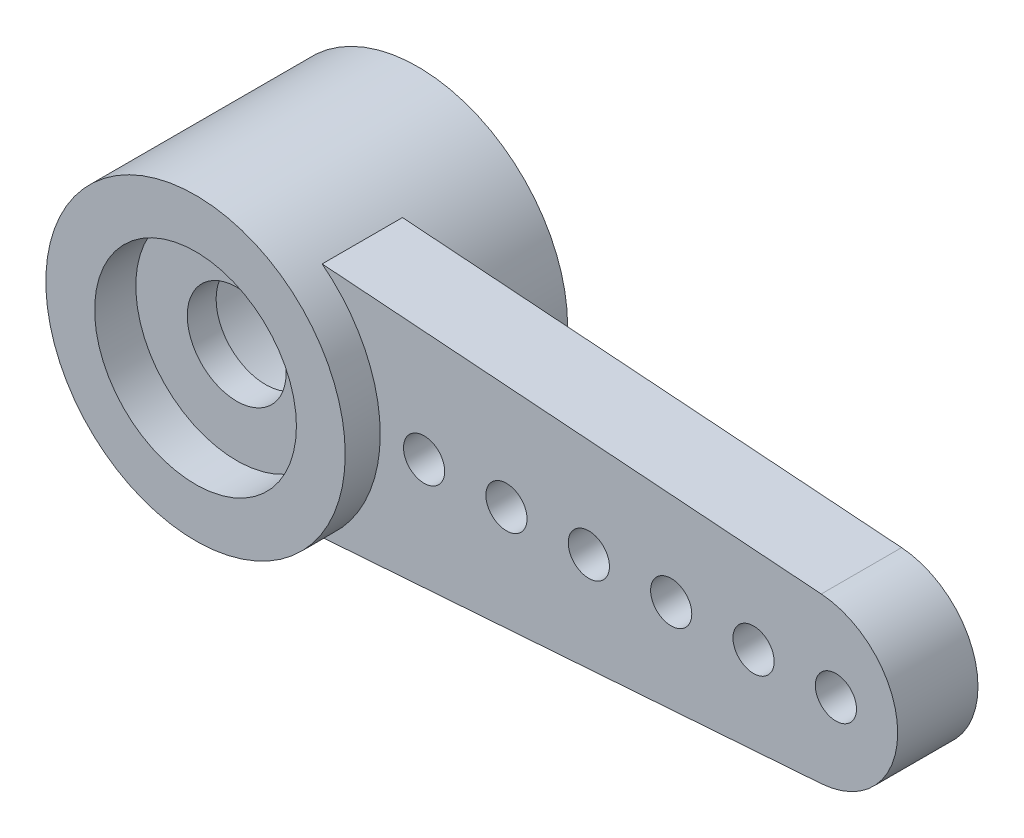
ISO-10303-21;
HEADER;
FILE_DESCRIPTION(('STEP AP214'),'2;1');
FILE_NAME('part.step','',(''),(''),'','','');
FILE_SCHEMA(('AUTOMOTIVE_DESIGN { 1 0 10303 214 1 1 1 1 }'));
ENDSEC;
DATA;
#1=APPLICATION_CONTEXT('core data for automotive mechanical design processes');
#2=APPLICATION_PROTOCOL_DEFINITION('international standard','automotive_design',2000,#1);
#3=PRODUCT_CONTEXT('',#1,'mechanical');
#4=PRODUCT('Part','Part','',(#3));
#5=PRODUCT_RELATED_PRODUCT_CATEGORY('part','',(#4));
#6=PRODUCT_DEFINITION_FORMATION('','',#4);
#7=PRODUCT_DEFINITION_CONTEXT('part definition',#1,'design');
#8=PRODUCT_DEFINITION('design','',#6,#7);
#9=PRODUCT_DEFINITION_SHAPE('','',#8);
#10=(LENGTH_UNIT() NAMED_UNIT(*) SI_UNIT(.MILLI.,.METRE.));
#11=(NAMED_UNIT(*) PLANE_ANGLE_UNIT() SI_UNIT($,.RADIAN.));
#12=(NAMED_UNIT(*) SI_UNIT($,.STERADIAN.) SOLID_ANGLE_UNIT());
#13=UNCERTAINTY_MEASURE_WITH_UNIT(LENGTH_MEASURE(1.E-05),#10,'distance_accuracy_value','');
#14=(GEOMETRIC_REPRESENTATION_CONTEXT(3) GLOBAL_UNCERTAINTY_ASSIGNED_CONTEXT((#13)) GLOBAL_UNIT_ASSIGNED_CONTEXT((#10,
#11,#12)) REPRESENTATION_CONTEXT('',''));
#15=CARTESIAN_POINT('',(0.,0.,0.));
#16=DIRECTION('',(0.,0.,1.));
#17=DIRECTION('',(1.,0.,0.));
#18=AXIS2_PLACEMENT_3D('',#15,#16,#17);
#19=CARTESIAN_POINT('',(0.,0.,5.4));
#20=DIRECTION('',(0.,0.,-1.));
#21=DIRECTION('',(-1.,0.,0.));
#22=AXIS2_PLACEMENT_3D('',#19,#20,#21);
#23=CYLINDRICAL_SURFACE('',#22,1.2);
#24=CARTESIAN_POINT('',(0.,0.,4.4));
#25=DIRECTION('',(0.,0.,1.));
#26=DIRECTION('',(1.,0.,0.));
#27=AXIS2_PLACEMENT_3D('',#24,#25,#26);
#28=CIRCLE('',#27,1.2);
#29=CARTESIAN_POINT('',(1.2,0.,4.4));
#30=VERTEX_POINT('',#29);
#31=EDGE_CURVE('E112',#30,#30,#28,.T.);
#32=ORIENTED_EDGE('',*,*,#31,.T.);
#33=EDGE_LOOP('',(#32));
#34=FACE_BOUND('',#33,.T.);
#35=CARTESIAN_POINT('',(0.,0.,3.7));
#36=DIRECTION('',(0.,0.,-1.));
#37=DIRECTION('',(-1.,0.,0.));
#38=AXIS2_PLACEMENT_3D('',#35,#36,#37);
#39=CIRCLE('',#38,1.2);
#40=CARTESIAN_POINT('',(-1.2,0.,3.7));
#41=VERTEX_POINT('',#40);
#42=EDGE_CURVE('E43',#41,#41,#39,.T.);
#43=ORIENTED_EDGE('',*,*,#42,.T.);
#44=EDGE_LOOP('',(#43));
#45=FACE_BOUND('',#44,.T.);
#46=ADVANCED_FACE('F39',(#34,#45),#23,.F.);
#47=CARTESIAN_POINT('',(0.,0.,5.4));
#48=DIRECTION('',(0.,0.,-1.));
#49=DIRECTION('',(-1.,0.,0.));
#50=AXIS2_PLACEMENT_3D('',#47,#48,#49);
#51=CYLINDRICAL_SURFACE('',#50,3.635);
#52=CARTESIAN_POINT('',(0.,0.,0.));
#53=DIRECTION('',(0.,0.,1.));
#54=DIRECTION('',(1.,0.,0.));
#55=AXIS2_PLACEMENT_3D('',#52,#53,#54);
#56=CIRCLE('',#55,3.635);
#57=CARTESIAN_POINT('',(3.635,0.,0.));
#58=VERTEX_POINT('',#57);
#59=EDGE_CURVE('E48',#58,#58,#56,.T.);
#60=ORIENTED_EDGE('',*,*,#59,.T.);
#61=EDGE_LOOP('',(#60));
#62=FACE_BOUND('',#61,.T.);
#63=CARTESIAN_POINT('',(0.,0.,5.4));
#64=DIRECTION('',(0.,0.,1.));
#65=DIRECTION('',(1.,0.,0.));
#66=AXIS2_PLACEMENT_3D('',#63,#64,#65);
#67=CIRCLE('',#66,3.635);
#68=CARTESIAN_POINT('',(3.635,0.,5.4));
#69=VERTEX_POINT('',#68);
#70=EDGE_CURVE('E11',#69,#69,#67,.T.);
#71=ORIENTED_EDGE('',*,*,#70,.F.);
#72=EDGE_LOOP('',(#71));
#73=FACE_BOUND('',#72,.T.);
#74=CARTESIAN_POINT('',(0.,0.,2.6));
#75=DIRECTION('',(0.,0.,1.));
#76=DIRECTION('',(1.,0.,0.));
#77=AXIS2_PLACEMENT_3D('',#74,#75,#76);
#78=CIRCLE('',#77,3.635);
#79=CARTESIAN_POINT('',(2.22432012084592,2.875,2.6));
#80=VERTEX_POINT('',#79);
#81=CARTESIAN_POINT('',(2.22432012084592,-2.875,2.6));
#82=VERTEX_POINT('',#81);
#83=EDGE_CURVE('E103',#80,#82,#78,.F.);
#84=ORIENTED_EDGE('',*,*,#83,.T.);
#85=DIRECTION('',(0.,0.,1.));
#86=VECTOR('',#85,1.);
#87=CARTESIAN_POINT('',(2.22432012084592,-2.875,2.6));
#88=LINE('',#87,#86);
#89=CARTESIAN_POINT('',(2.22432012084592,-2.875,4.55));
#90=VERTEX_POINT('',#89);
#91=EDGE_CURVE('E87',#82,#90,#88,.T.);
#92=ORIENTED_EDGE('',*,*,#91,.T.);
#93=CARTESIAN_POINT('',(0.,0.,4.55));
#94=DIRECTION('',(0.,0.,1.));
#95=DIRECTION('',(1.,0.,0.));
#96=AXIS2_PLACEMENT_3D('',#93,#94,#95);
#97=CIRCLE('',#96,3.635);
#98=CARTESIAN_POINT('',(2.22432012084592,2.875,4.55));
#99=VERTEX_POINT('',#98);
#100=EDGE_CURVE('E109',#99,#90,#97,.F.);
#101=ORIENTED_EDGE('',*,*,#100,.F.);
#102=DIRECTION('',(0.,0.,1.));
#103=VECTOR('',#102,1.);
#104=CARTESIAN_POINT('',(2.22432012084592,2.875,2.6));
#105=LINE('',#104,#103);
#106=EDGE_CURVE('E116',#80,#99,#105,.T.);
#107=ORIENTED_EDGE('',*,*,#106,.F.);
#108=EDGE_LOOP('',(#84,#92,#101,#107));
#109=FACE_BOUND('',#108,.T.);
#110=ADVANCED_FACE('F41',(#62,#73,#109),#51,.T.);
#111=CARTESIAN_POINT('',(0.,0.,5.4));
#112=DIRECTION('',(0.,0.,1.));
#113=DIRECTION('',(1.,0.,0.));
#114=AXIS2_PLACEMENT_3D('',#111,#112,#113);
#115=PLANE('',#114);
#116=CARTESIAN_POINT('',(0.,0.,5.4));
#117=DIRECTION('',(0.,0.,1.));
#118=DIRECTION('',(1.,0.,0.));
#119=AXIS2_PLACEMENT_3D('',#116,#117,#118);
#120=CIRCLE('',#119,2.45);
#121=CARTESIAN_POINT('',(2.45,0.,5.4));
#122=VERTEX_POINT('',#121);
#123=EDGE_CURVE('E126',#122,#122,#120,.T.);
#124=ORIENTED_EDGE('',*,*,#123,.F.);
#125=EDGE_LOOP('',(#124));
#126=FACE_BOUND('',#125,.T.);
#127=ORIENTED_EDGE('',*,*,#70,.T.);
#128=EDGE_LOOP('',(#127));
#129=FACE_BOUND('',#128,.T.);
#130=ADVANCED_FACE('F204',(#126,#129),#115,.T.);
#131=CARTESIAN_POINT('',(0.,0.,0.));
#132=DIRECTION('',(0.,0.,1.));
#133=DIRECTION('',(1.,0.,0.));
#134=AXIS2_PLACEMENT_3D('',#131,#132,#133);
#135=PLANE('',#134);
#136=CARTESIAN_POINT('',(0.,0.,0.));
#137=DIRECTION('',(0.,0.,-1.));
#138=DIRECTION('',(-1.,0.,0.));
#139=AXIS2_PLACEMENT_3D('',#136,#137,#138);
#140=CIRCLE('',#139,2.45);
#141=CARTESIAN_POINT('',(-2.45,0.,0.));
#142=VERTEX_POINT('',#141);
#143=EDGE_CURVE('E132',#142,#142,#140,.T.);
#144=ORIENTED_EDGE('',*,*,#143,.F.);
#145=EDGE_LOOP('',(#144));
#146=FACE_BOUND('',#145,.T.);
#147=ORIENTED_EDGE('',*,*,#59,.F.);
#148=EDGE_LOOP('',(#147));
#149=FACE_BOUND('',#148,.T.);
#150=ADVANCED_FACE('F197',(#146,#149),#135,.F.);
#151=CARTESIAN_POINT('',(0.219371442646651,3.02060919837169,2.6));
#152=DIRECTION('',(-0.0724341293504972,-0.997373198409319,0.));
#153=DIRECTION('',(0.997373198409319,-0.0724341293504972,0.));
#154=AXIS2_PLACEMENT_3D('',#151,#152,#153);
#155=PLANE('',#154);
#156=DIRECTION('',(0.997373198409319,-0.0724341293504972,0.));
#157=VECTOR('',#156,1.);
#158=CARTESIAN_POINT('',(0.219371442646651,3.02060919837169,4.55));
#159=LINE('',#158,#157);
#160=CARTESIAN_POINT('',(14.344868258701,1.99474639681864,4.55));
#161=VERTEX_POINT('',#160);
#162=EDGE_CURVE('E56',#99,#161,#159,.T.);
#163=ORIENTED_EDGE('',*,*,#162,.T.);
#164=DIRECTION('',(0.,0.,1.));
#165=VECTOR('',#164,1.);
#166=CARTESIAN_POINT('',(14.344868258701,1.99474639681864,2.6));
#167=LINE('',#166,#165);
#168=CARTESIAN_POINT('',(14.344868258701,1.99474639681864,2.6));
#169=VERTEX_POINT('',#168);
#170=EDGE_CURVE('E81',#169,#161,#167,.T.);
#171=ORIENTED_EDGE('',*,*,#170,.F.);
#172=DIRECTION('',(0.997373198409319,-0.0724341293504972,0.));
#173=VECTOR('',#172,1.);
#174=CARTESIAN_POINT('',(0.219371442646651,3.02060919837169,2.6));
#175=LINE('',#174,#173);
#176=EDGE_CURVE('E64',#80,#169,#175,.T.);
#177=ORIENTED_EDGE('',*,*,#176,.F.);
#178=ORIENTED_EDGE('',*,*,#106,.T.);
#179=EDGE_LOOP('',(#163,#171,#177,#178));
#180=FACE_BOUND('',#179,.T.);
#181=ADVANCED_FACE('F195',(#180),#155,.F.);
#182=CARTESIAN_POINT('',(14.2,0.,2.6));
#183=DIRECTION('',(0.,0.,1.));
#184=DIRECTION('',(1.,0.,0.));
#185=AXIS2_PLACEMENT_3D('',#182,#183,#184);
#186=CYLINDRICAL_SURFACE('',#185,2.);
#187=CARTESIAN_POINT('',(14.2,0.,4.55));
#188=DIRECTION('',(0.,0.,1.));
#189=DIRECTION('',(1.,0.,0.));
#190=AXIS2_PLACEMENT_3D('',#187,#188,#189);
#191=CIRCLE('',#190,2.);
#192=CARTESIAN_POINT('',(14.344868258701,-1.99474639681864,4.55));
#193=VERTEX_POINT('',#192);
#194=EDGE_CURVE('E94',#193,#161,#191,.T.);
#195=ORIENTED_EDGE('',*,*,#194,.F.);
#196=DIRECTION('',(0.,0.,1.));
#197=VECTOR('',#196,1.);
#198=CARTESIAN_POINT('',(14.344868258701,-1.99474639681864,2.6));
#199=LINE('',#198,#197);
#200=CARTESIAN_POINT('',(14.344868258701,-1.99474639681864,2.6));
#201=VERTEX_POINT('',#200);
#202=EDGE_CURVE('E90',#201,#193,#199,.T.);
#203=ORIENTED_EDGE('',*,*,#202,.F.);
#204=CARTESIAN_POINT('',(14.2,0.,2.6));
#205=DIRECTION('',(0.,0.,1.));
#206=DIRECTION('',(1.,0.,0.));
#207=AXIS2_PLACEMENT_3D('',#204,#205,#206);
#208=CIRCLE('',#207,2.);
#209=EDGE_CURVE('E93',#201,#169,#208,.T.);
#210=ORIENTED_EDGE('',*,*,#209,.T.);
#211=ORIENTED_EDGE('',*,*,#170,.T.);
#212=EDGE_LOOP('',(#195,#203,#210,#211));
#213=FACE_BOUND('',#212,.T.);
#214=ADVANCED_FACE('F92',(#213),#186,.T.);
#215=CARTESIAN_POINT('',(0.219371442646651,-3.02060919837169,2.6));
#216=DIRECTION('',(0.0724341293504972,-0.997373198409319,0.));
#217=DIRECTION('',(0.997373198409319,0.0724341293504972,0.));
#218=AXIS2_PLACEMENT_3D('',#215,#216,#217);
#219=PLANE('',#218);
#220=DIRECTION('',(0.997373198409319,0.0724341293504972,0.));
#221=VECTOR('',#220,1.);
#222=CARTESIAN_POINT('',(0.219371442646651,-3.02060919837169,4.55));
#223=LINE('',#222,#221);
#224=EDGE_CURVE('E111',#90,#193,#223,.T.);
#225=ORIENTED_EDGE('',*,*,#224,.F.);
#226=ORIENTED_EDGE('',*,*,#91,.F.);
#227=DIRECTION('',(0.997373198409319,0.0724341293504972,0.));
#228=VECTOR('',#227,1.);
#229=CARTESIAN_POINT('',(0.219371442646651,-3.02060919837169,2.6));
#230=LINE('',#229,#228);
#231=EDGE_CURVE('E99',#82,#201,#230,.T.);
#232=ORIENTED_EDGE('',*,*,#231,.T.);
#233=ORIENTED_EDGE('',*,*,#202,.T.);
#234=EDGE_LOOP('',(#225,#226,#232,#233));
#235=FACE_BOUND('',#234,.T.);
#236=ADVANCED_FACE('F102',(#235),#219,.T.);
#237=CARTESIAN_POINT('',(0.,0.,2.6));
#238=DIRECTION('',(0.,0.,1.));
#239=DIRECTION('',(1.,0.,0.));
#240=AXIS2_PLACEMENT_3D('',#237,#238,#239);
#241=PLANE('',#240);
#242=CARTESIAN_POINT('',(14.7,0.,2.6));
#243=DIRECTION('',(0.,0.,1.));
#244=DIRECTION('',(1.,0.,0.));
#245=AXIS2_PLACEMENT_3D('',#242,#243,#244);
#246=CIRCLE('',#245,0.500000000000001);
#247=CARTESIAN_POINT('',(15.2,0.,2.6));
#248=VERTEX_POINT('',#247);
#249=EDGE_CURVE('E136',#248,#248,#246,.T.);
#250=ORIENTED_EDGE('',*,*,#249,.T.);
#251=EDGE_LOOP('',(#250));
#252=FACE_BOUND('',#251,.T.);
#253=CARTESIAN_POINT('',(12.7,0.,2.6));
#254=DIRECTION('',(0.,0.,1.));
#255=DIRECTION('',(1.,0.,0.));
#256=AXIS2_PLACEMENT_3D('',#253,#254,#255);
#257=CIRCLE('',#256,0.500000000000001);
#258=CARTESIAN_POINT('',(13.2,0.,2.6));
#259=VERTEX_POINT('',#258);
#260=EDGE_CURVE('E141',#259,#259,#257,.T.);
#261=ORIENTED_EDGE('',*,*,#260,.T.);
#262=EDGE_LOOP('',(#261));
#263=FACE_BOUND('',#262,.T.);
#264=CARTESIAN_POINT('',(10.7,0.,2.6));
#265=DIRECTION('',(0.,0.,1.));
#266=DIRECTION('',(1.,0.,0.));
#267=AXIS2_PLACEMENT_3D('',#264,#265,#266);
#268=CIRCLE('',#267,0.500000000000001);
#269=CARTESIAN_POINT('',(11.2,0.,2.6));
#270=VERTEX_POINT('',#269);
#271=EDGE_CURVE('E144',#270,#270,#268,.T.);
#272=ORIENTED_EDGE('',*,*,#271,.T.);
#273=EDGE_LOOP('',(#272));
#274=FACE_BOUND('',#273,.T.);
#275=CARTESIAN_POINT('',(8.7,0.,2.6));
#276=DIRECTION('',(0.,0.,1.));
#277=DIRECTION('',(1.,0.,0.));
#278=AXIS2_PLACEMENT_3D('',#275,#276,#277);
#279=CIRCLE('',#278,0.500000000000001);
#280=CARTESIAN_POINT('',(9.2,0.,2.6));
#281=VERTEX_POINT('',#280);
#282=EDGE_CURVE('E147',#281,#281,#279,.T.);
#283=ORIENTED_EDGE('',*,*,#282,.T.);
#284=EDGE_LOOP('',(#283));
#285=FACE_BOUND('',#284,.T.);
#286=CARTESIAN_POINT('',(6.7,0.,2.6));
#287=DIRECTION('',(0.,0.,1.));
#288=DIRECTION('',(1.,0.,0.));
#289=AXIS2_PLACEMENT_3D('',#286,#287,#288);
#290=CIRCLE('',#289,0.500000000000001);
#291=CARTESIAN_POINT('',(7.2,0.,2.6));
#292=VERTEX_POINT('',#291);
#293=EDGE_CURVE('E150',#292,#292,#290,.T.);
#294=ORIENTED_EDGE('',*,*,#293,.T.);
#295=EDGE_LOOP('',(#294));
#296=FACE_BOUND('',#295,.T.);
#297=CARTESIAN_POINT('',(4.7,0.,2.6));
#298=DIRECTION('',(0.,0.,1.));
#299=DIRECTION('',(1.,0.,0.));
#300=AXIS2_PLACEMENT_3D('',#297,#298,#299);
#301=CIRCLE('',#300,0.500000000000001);
#302=CARTESIAN_POINT('',(5.2,0.,2.6));
#303=VERTEX_POINT('',#302);
#304=EDGE_CURVE('E153',#303,#303,#301,.T.);
#305=ORIENTED_EDGE('',*,*,#304,.T.);
#306=EDGE_LOOP('',(#305));
#307=FACE_BOUND('',#306,.T.);
#308=ORIENTED_EDGE('',*,*,#83,.F.);
#309=ORIENTED_EDGE('',*,*,#176,.T.);
#310=ORIENTED_EDGE('',*,*,#209,.F.);
#311=ORIENTED_EDGE('',*,*,#231,.F.);
#312=EDGE_LOOP('',(#308,#309,#310,#311));
#313=FACE_BOUND('',#312,.T.);
#314=ADVANCED_FACE('F98',(#252,#263,#274,#285,#296,#307,#313),#241,.F.);
#315=CARTESIAN_POINT('',(0.,0.,4.55));
#316=DIRECTION('',(0.,0.,1.));
#317=DIRECTION('',(1.,0.,0.));
#318=AXIS2_PLACEMENT_3D('',#315,#316,#317);
#319=PLANE('',#318);
#320=CARTESIAN_POINT('',(14.7,0.,4.55));
#321=DIRECTION('',(0.,0.,1.));
#322=DIRECTION('',(1.,0.,0.));
#323=AXIS2_PLACEMENT_3D('',#320,#321,#322);
#324=CIRCLE('',#323,0.500000000000001);
#325=CARTESIAN_POINT('',(15.2,0.,4.55));
#326=VERTEX_POINT('',#325);
#327=EDGE_CURVE('E156',#326,#326,#324,.T.);
#328=ORIENTED_EDGE('',*,*,#327,.F.);
#329=EDGE_LOOP('',(#328));
#330=FACE_BOUND('',#329,.T.);
#331=CARTESIAN_POINT('',(12.7,0.,4.55));
#332=DIRECTION('',(0.,0.,1.));
#333=DIRECTION('',(1.,0.,0.));
#334=AXIS2_PLACEMENT_3D('',#331,#332,#333);
#335=CIRCLE('',#334,0.500000000000001);
#336=CARTESIAN_POINT('',(13.2,0.,4.55));
#337=VERTEX_POINT('',#336);
#338=EDGE_CURVE('E169',#337,#337,#335,.T.);
#339=ORIENTED_EDGE('',*,*,#338,.F.);
#340=EDGE_LOOP('',(#339));
#341=FACE_BOUND('',#340,.T.);
#342=CARTESIAN_POINT('',(10.7,0.,4.55));
#343=DIRECTION('',(0.,0.,1.));
#344=DIRECTION('',(1.,0.,0.));
#345=AXIS2_PLACEMENT_3D('',#342,#343,#344);
#346=CIRCLE('',#345,0.500000000000001);
#347=CARTESIAN_POINT('',(11.2,0.,4.55));
#348=VERTEX_POINT('',#347);
#349=EDGE_CURVE('E166',#348,#348,#346,.T.);
#350=ORIENTED_EDGE('',*,*,#349,.F.);
#351=EDGE_LOOP('',(#350));
#352=FACE_BOUND('',#351,.T.);
#353=CARTESIAN_POINT('',(8.7,0.,4.55));
#354=DIRECTION('',(0.,0.,1.));
#355=DIRECTION('',(1.,0.,0.));
#356=AXIS2_PLACEMENT_3D('',#353,#354,#355);
#357=CIRCLE('',#356,0.500000000000001);
#358=CARTESIAN_POINT('',(9.2,0.,4.55));
#359=VERTEX_POINT('',#358);
#360=EDGE_CURVE('E163',#359,#359,#357,.T.);
#361=ORIENTED_EDGE('',*,*,#360,.F.);
#362=EDGE_LOOP('',(#361));
#363=FACE_BOUND('',#362,.T.);
#364=CARTESIAN_POINT('',(6.7,0.,4.55));
#365=DIRECTION('',(0.,0.,1.));
#366=DIRECTION('',(1.,0.,0.));
#367=AXIS2_PLACEMENT_3D('',#364,#365,#366);
#368=CIRCLE('',#367,0.500000000000001);
#369=CARTESIAN_POINT('',(7.2,0.,4.55));
#370=VERTEX_POINT('',#369);
#371=EDGE_CURVE('E160',#370,#370,#368,.T.);
#372=ORIENTED_EDGE('',*,*,#371,.F.);
#373=EDGE_LOOP('',(#372));
#374=FACE_BOUND('',#373,.T.);
#375=CARTESIAN_POINT('',(4.7,0.,4.55));
#376=DIRECTION('',(0.,0.,1.));
#377=DIRECTION('',(1.,0.,0.));
#378=AXIS2_PLACEMENT_3D('',#375,#376,#377);
#379=CIRCLE('',#378,0.500000000000001);
#380=CARTESIAN_POINT('',(5.2,0.,4.55));
#381=VERTEX_POINT('',#380);
#382=EDGE_CURVE('E157',#381,#381,#379,.T.);
#383=ORIENTED_EDGE('',*,*,#382,.F.);
#384=EDGE_LOOP('',(#383));
#385=FACE_BOUND('',#384,.T.);
#386=ORIENTED_EDGE('',*,*,#100,.T.);
#387=ORIENTED_EDGE('',*,*,#224,.T.);
#388=ORIENTED_EDGE('',*,*,#194,.T.);
#389=ORIENTED_EDGE('',*,*,#162,.F.);
#390=EDGE_LOOP('',(#386,#387,#388,#389));
#391=FACE_BOUND('',#390,.T.);
#392=ADVANCED_FACE('F178',(#330,#341,#352,#363,#374,#385,#391),#319,.T.);
#393=CARTESIAN_POINT('',(0.,0.,4.4));
#394=DIRECTION('',(0.,0.,1.));
#395=DIRECTION('',(1.,0.,0.));
#396=AXIS2_PLACEMENT_3D('',#393,#394,#395);
#397=CYLINDRICAL_SURFACE('',#396,2.45);
#398=CARTESIAN_POINT('',(0.,0.,4.4));
#399=DIRECTION('',(0.,0.,1.));
#400=DIRECTION('',(1.,0.,0.));
#401=AXIS2_PLACEMENT_3D('',#398,#399,#400);
#402=CIRCLE('',#401,2.45);
#403=CARTESIAN_POINT('',(2.45,0.,4.4));
#404=VERTEX_POINT('',#403);
#405=EDGE_CURVE('E122',#404,#404,#402,.T.);
#406=ORIENTED_EDGE('',*,*,#405,.F.);
#407=EDGE_LOOP('',(#406));
#408=FACE_BOUND('',#407,.T.);
#409=ORIENTED_EDGE('',*,*,#123,.T.);
#410=EDGE_LOOP('',(#409));
#411=FACE_BOUND('',#410,.T.);
#412=ADVANCED_FACE('F181',(#408,#411),#397,.F.);
#413=CARTESIAN_POINT('',(0.,0.,4.4));
#414=DIRECTION('',(0.,0.,1.));
#415=DIRECTION('',(1.,0.,0.));
#416=AXIS2_PLACEMENT_3D('',#413,#414,#415);
#417=PLANE('',#416);
#418=ORIENTED_EDGE('',*,*,#31,.F.);
#419=EDGE_LOOP('',(#418));
#420=FACE_BOUND('',#419,.T.);
#421=ORIENTED_EDGE('',*,*,#405,.T.);
#422=EDGE_LOOP('',(#421));
#423=FACE_BOUND('',#422,.T.);
#424=ADVANCED_FACE('F225',(#420,#423),#417,.T.);
#425=CARTESIAN_POINT('',(0.,0.,3.7));
#426=DIRECTION('',(0.,0.,-1.));
#427=DIRECTION('',(-1.,0.,0.));
#428=AXIS2_PLACEMENT_3D('',#425,#426,#427);
#429=CYLINDRICAL_SURFACE('',#428,2.45);
#430=CARTESIAN_POINT('',(0.,0.,3.7));
#431=DIRECTION('',(0.,0.,-1.));
#432=DIRECTION('',(-1.,0.,0.));
#433=AXIS2_PLACEMENT_3D('',#430,#431,#432);
#434=CIRCLE('',#433,2.45);
#435=CARTESIAN_POINT('',(-2.45,0.,3.7));
#436=VERTEX_POINT('',#435);
#437=EDGE_CURVE('E135',#436,#436,#434,.T.);
#438=ORIENTED_EDGE('',*,*,#437,.F.);
#439=EDGE_LOOP('',(#438));
#440=FACE_BOUND('',#439,.T.);
#441=ORIENTED_EDGE('',*,*,#143,.T.);
#442=EDGE_LOOP('',(#441));
#443=FACE_BOUND('',#442,.T.);
#444=ADVANCED_FACE('F232',(#440,#443),#429,.F.);
#445=CARTESIAN_POINT('',(0.,0.,3.7));
#446=DIRECTION('',(0.,0.,-1.));
#447=DIRECTION('',(-1.,0.,0.));
#448=AXIS2_PLACEMENT_3D('',#445,#446,#447);
#449=PLANE('',#448);
#450=ORIENTED_EDGE('',*,*,#42,.F.);
#451=EDGE_LOOP('',(#450));
#452=FACE_BOUND('',#451,.T.);
#453=ORIENTED_EDGE('',*,*,#437,.T.);
#454=EDGE_LOOP('',(#453));
#455=FACE_BOUND('',#454,.T.);
#456=ADVANCED_FACE('F258',(#452,#455),#449,.T.);
#457=CARTESIAN_POINT('',(4.7,0.,0.85));
#458=DIRECTION('',(0.,0.,1.));
#459=DIRECTION('',(1.,0.,0.));
#460=AXIS2_PLACEMENT_3D('',#457,#458,#459);
#461=CYLINDRICAL_SURFACE('',#460,0.500000000000001);
#462=ORIENTED_EDGE('',*,*,#382,.T.);
#463=EDGE_LOOP('',(#462));
#464=FACE_BOUND('',#463,.T.);
#465=ORIENTED_EDGE('',*,*,#304,.F.);
#466=EDGE_LOOP('',(#465));
#467=FACE_BOUND('',#466,.T.);
#468=ADVANCED_FACE('F255',(#464,#467),#461,.F.);
#469=CARTESIAN_POINT('',(6.7,0.,0.85));
#470=DIRECTION('',(0.,0.,1.));
#471=DIRECTION('',(1.,0.,0.));
#472=AXIS2_PLACEMENT_3D('',#469,#470,#471);
#473=CYLINDRICAL_SURFACE('',#472,0.500000000000001);
#474=ORIENTED_EDGE('',*,*,#371,.T.);
#475=EDGE_LOOP('',(#474));
#476=FACE_BOUND('',#475,.T.);
#477=ORIENTED_EDGE('',*,*,#293,.F.);
#478=EDGE_LOOP('',(#477));
#479=FACE_BOUND('',#478,.T.);
#480=ADVANCED_FACE('F257',(#476,#479),#473,.F.);
#481=CARTESIAN_POINT('',(8.7,0.,0.85));
#482=DIRECTION('',(0.,0.,1.));
#483=DIRECTION('',(1.,0.,0.));
#484=AXIS2_PLACEMENT_3D('',#481,#482,#483);
#485=CYLINDRICAL_SURFACE('',#484,0.500000000000001);
#486=ORIENTED_EDGE('',*,*,#360,.T.);
#487=EDGE_LOOP('',(#486));
#488=FACE_BOUND('',#487,.T.);
#489=ORIENTED_EDGE('',*,*,#282,.F.);
#490=EDGE_LOOP('',(#489));
#491=FACE_BOUND('',#490,.T.);
#492=ADVANCED_FACE('F265',(#488,#491),#485,.F.);
#493=CARTESIAN_POINT('',(10.7,0.,0.85));
#494=DIRECTION('',(0.,0.,1.));
#495=DIRECTION('',(1.,0.,0.));
#496=AXIS2_PLACEMENT_3D('',#493,#494,#495);
#497=CYLINDRICAL_SURFACE('',#496,0.500000000000001);
#498=ORIENTED_EDGE('',*,*,#349,.T.);
#499=EDGE_LOOP('',(#498));
#500=FACE_BOUND('',#499,.T.);
#501=ORIENTED_EDGE('',*,*,#271,.F.);
#502=EDGE_LOOP('',(#501));
#503=FACE_BOUND('',#502,.T.);
#504=ADVANCED_FACE('F317',(#500,#503),#497,.F.);
#505=CARTESIAN_POINT('',(12.7,0.,0.85));
#506=DIRECTION('',(0.,0.,1.));
#507=DIRECTION('',(1.,0.,0.));
#508=AXIS2_PLACEMENT_3D('',#505,#506,#507);
#509=CYLINDRICAL_SURFACE('',#508,0.500000000000001);
#510=ORIENTED_EDGE('',*,*,#338,.T.);
#511=EDGE_LOOP('',(#510));
#512=FACE_BOUND('',#511,.T.);
#513=ORIENTED_EDGE('',*,*,#260,.F.);
#514=EDGE_LOOP('',(#513));
#515=FACE_BOUND('',#514,.T.);
#516=ADVANCED_FACE('F327',(#512,#515),#509,.F.);
#517=CARTESIAN_POINT('',(14.7,0.,0.85));
#518=DIRECTION('',(0.,0.,1.));
#519=DIRECTION('',(1.,0.,0.));
#520=AXIS2_PLACEMENT_3D('',#517,#518,#519);
#521=CYLINDRICAL_SURFACE('',#520,0.500000000000001);
#522=ORIENTED_EDGE('',*,*,#327,.T.);
#523=EDGE_LOOP('',(#522));
#524=FACE_BOUND('',#523,.T.);
#525=ORIENTED_EDGE('',*,*,#249,.F.);
#526=EDGE_LOOP('',(#525));
#527=FACE_BOUND('',#526,.T.);
#528=ADVANCED_FACE('F175',(#524,#527),#521,.F.);
#529=CLOSED_SHELL('',(#46,#110,#130,#150,#181,#214,#236,#314,#392,#412,#424,#444,#456,#468,#480,
#492,#504,#516,#528));
#530=MANIFOLD_SOLID_BREP('B2',#529);
#531=ADVANCED_BREP_SHAPE_REPRESENTATION('',(#18,#530),#14);
#532=SHAPE_DEFINITION_REPRESENTATION(#9,#531);
ENDSEC;
END-ISO-10303-21;
